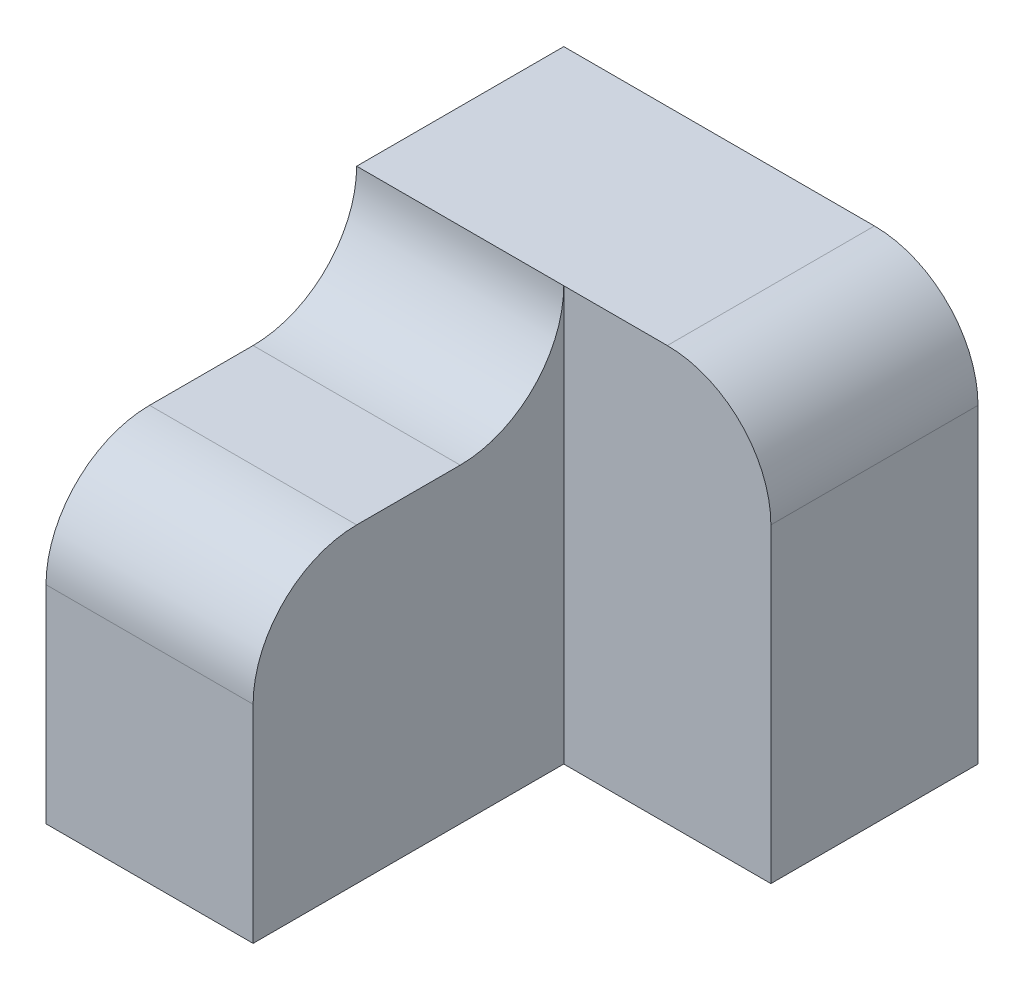
ISO-10303-21;
HEADER;
FILE_DESCRIPTION(('STEP AP214'),'2;1');
FILE_NAME('part.step','',(''),(''),'','','');
FILE_SCHEMA(('AUTOMOTIVE_DESIGN { 1 0 10303 214 1 1 1 1 }'));
ENDSEC;
DATA;
#1=APPLICATION_CONTEXT('core data for automotive mechanical design processes');
#2=APPLICATION_PROTOCOL_DEFINITION('international standard','automotive_design',2000,#1);
#3=PRODUCT_CONTEXT('',#1,'mechanical');
#4=PRODUCT('Part','Part','',(#3));
#5=PRODUCT_RELATED_PRODUCT_CATEGORY('part','',(#4));
#6=PRODUCT_DEFINITION_FORMATION('','',#4);
#7=PRODUCT_DEFINITION_CONTEXT('part definition',#1,'design');
#8=PRODUCT_DEFINITION('design','',#6,#7);
#9=PRODUCT_DEFINITION_SHAPE('','',#8);
#10=(LENGTH_UNIT() NAMED_UNIT(*) SI_UNIT(.MILLI.,.METRE.));
#11=(NAMED_UNIT(*) PLANE_ANGLE_UNIT() SI_UNIT($,.RADIAN.));
#12=(NAMED_UNIT(*) SI_UNIT($,.STERADIAN.) SOLID_ANGLE_UNIT());
#13=UNCERTAINTY_MEASURE_WITH_UNIT(LENGTH_MEASURE(1.E-05),#10,'distance_accuracy_value','');
#14=(GEOMETRIC_REPRESENTATION_CONTEXT(3) GLOBAL_UNCERTAINTY_ASSIGNED_CONTEXT((#13)) GLOBAL_UNIT_ASSIGNED_CONTEXT((#10,
#11,#12)) REPRESENTATION_CONTEXT('',''));
#15=CARTESIAN_POINT('',(0.,0.,0.));
#16=DIRECTION('',(0.,0.,1.));
#17=DIRECTION('',(1.,0.,0.));
#18=AXIS2_PLACEMENT_3D('',#15,#16,#17);
#19=CARTESIAN_POINT('',(-10.,0.,30.));
#20=DIRECTION('',(0.,-1.,0.));
#21=DIRECTION('',(1.,0.,0.));
#22=AXIS2_PLACEMENT_3D('',#19,#20,#21);
#23=PLANE('',#22);
#24=DIRECTION('',(0.,0.,-1.));
#25=VECTOR('',#24,1.);
#26=CARTESIAN_POINT('',(-10.,0.,30.));
#27=LINE('',#26,#25);
#28=CARTESIAN_POINT('',(-10.,0.,20.));
#29=VERTEX_POINT('',#28);
#30=CARTESIAN_POINT('',(-10.,0.,10.));
#31=VERTEX_POINT('',#30);
#32=EDGE_CURVE('E161',#29,#31,#27,.T.);
#33=ORIENTED_EDGE('',*,*,#32,.T.);
#34=DIRECTION('',(-1.,0.,0.));
#35=VECTOR('',#34,1.);
#36=CARTESIAN_POINT('',(-10.,0.,10.));
#37=LINE('',#36,#35);
#38=CARTESIAN_POINT('',(-30.,0.,10.));
#39=VERTEX_POINT('',#38);
#40=EDGE_CURVE('E174',#31,#39,#37,.T.);
#41=ORIENTED_EDGE('',*,*,#40,.T.);
#42=DIRECTION('',(0.,0.,-1.));
#43=VECTOR('',#42,1.);
#44=CARTESIAN_POINT('',(-30.,0.,30.));
#45=LINE('',#44,#43);
#46=CARTESIAN_POINT('',(-30.,0.,20.));
#47=VERTEX_POINT('',#46);
#48=EDGE_CURVE('E170',#47,#39,#45,.T.);
#49=ORIENTED_EDGE('',*,*,#48,.F.);
#50=DIRECTION('',(-1.,0.,0.));
#51=VECTOR('',#50,1.);
#52=CARTESIAN_POINT('',(-10.,0.,20.));
#53=LINE('',#52,#51);
#54=EDGE_CURVE('E172',#47,#29,#53,.F.);
#55=ORIENTED_EDGE('',*,*,#54,.T.);
#56=EDGE_LOOP('',(#33,#41,#49,#55));
#57=FACE_BOUND('',#56,.T.);
#58=ADVANCED_FACE('F35',(#57),#23,.F.);
#59=CARTESIAN_POINT('',(-30.,0.,30.));
#60=DIRECTION('',(1.,0.,0.));
#61=DIRECTION('',(0.,0.,-1.));
#62=AXIS2_PLACEMENT_3D('',#59,#60,#61);
#63=PLANE('',#62);
#64=DIRECTION('',(0.,-1.,0.));
#65=VECTOR('',#64,1.);
#66=CARTESIAN_POINT('',(-30.,0.,30.));
#67=LINE('',#66,#65);
#68=CARTESIAN_POINT('',(-30.,-10.,30.));
#69=VERTEX_POINT('',#68);
#70=CARTESIAN_POINT('',(-30.,-30.,30.));
#71=VERTEX_POINT('',#70);
#72=EDGE_CURVE('E155',#69,#71,#67,.T.);
#73=ORIENTED_EDGE('',*,*,#72,.F.);
#74=CARTESIAN_POINT('',(-30.,-10.,20.));
#75=DIRECTION('',(1.,0.,0.));
#76=DIRECTION('',(0.,0.,-1.));
#77=AXIS2_PLACEMENT_3D('',#74,#75,#76);
#78=CIRCLE('',#77,10.);
#79=EDGE_CURVE('E58',#69,#47,#78,.F.);
#80=ORIENTED_EDGE('',*,*,#79,.T.);
#81=ORIENTED_EDGE('',*,*,#48,.T.);
#82=CARTESIAN_POINT('',(-30.,10.,10.));
#83=DIRECTION('',(1.,0.,0.));
#84=DIRECTION('',(0.,0.,-1.));
#85=AXIS2_PLACEMENT_3D('',#82,#83,#84);
#86=CIRCLE('',#85,10.);
#87=CARTESIAN_POINT('',(-30.,9.99999999999999,0.));
#88=VERTEX_POINT('',#87);
#89=EDGE_CURVE('E43',#39,#88,#86,.T.);
#90=ORIENTED_EDGE('',*,*,#89,.T.);
#91=DIRECTION('',(0.,0.,1.));
#92=VECTOR('',#91,1.);
#93=CARTESIAN_POINT('',(-30.,9.99999999999999,-20.));
#94=LINE('',#93,#92);
#95=CARTESIAN_POINT('',(-30.,9.99999999999999,-20.));
#96=VERTEX_POINT('',#95);
#97=EDGE_CURVE('E116',#96,#88,#94,.T.);
#98=ORIENTED_EDGE('',*,*,#97,.F.);
#99=DIRECTION('',(0.,-1.,0.));
#100=VECTOR('',#99,1.);
#101=CARTESIAN_POINT('',(-30.,9.99999999999999,-20.));
#102=LINE('',#101,#100);
#103=CARTESIAN_POINT('',(-30.,-30.,-20.));
#104=VERTEX_POINT('',#103);
#105=EDGE_CURVE('E123',#96,#104,#102,.T.);
#106=ORIENTED_EDGE('',*,*,#105,.T.);
#107=DIRECTION('',(0.,0.,-1.));
#108=VECTOR('',#107,1.);
#109=CARTESIAN_POINT('',(-30.,-30.,30.));
#110=LINE('',#109,#108);
#111=EDGE_CURVE('E168',#71,#104,#110,.T.);
#112=ORIENTED_EDGE('',*,*,#111,.F.);
#113=EDGE_LOOP('',(#73,#80,#81,#90,#98,#106,#112));
#114=FACE_BOUND('',#113,.T.);
#115=ADVANCED_FACE('F129',(#114),#63,.F.);
#116=CARTESIAN_POINT('',(-30.,-30.,30.));
#117=DIRECTION('',(0.,1.,0.));
#118=DIRECTION('',(0.,0.,1.));
#119=AXIS2_PLACEMENT_3D('',#116,#117,#118);
#120=PLANE('',#119);
#121=ORIENTED_EDGE('',*,*,#111,.T.);
#122=DIRECTION('',(1.,0.,0.));
#123=VECTOR('',#122,1.);
#124=CARTESIAN_POINT('',(-30.,-30.,-20.));
#125=LINE('',#124,#123);
#126=CARTESIAN_POINT('',(10.,-30.,-20.));
#127=VERTEX_POINT('',#126);
#128=EDGE_CURVE('E139',#104,#127,#125,.T.);
#129=ORIENTED_EDGE('',*,*,#128,.T.);
#130=DIRECTION('',(0.,0.,1.));
#131=VECTOR('',#130,1.);
#132=CARTESIAN_POINT('',(10.,-30.,-20.));
#133=LINE('',#132,#131);
#134=CARTESIAN_POINT('',(10.,-30.,0.));
#135=VERTEX_POINT('',#134);
#136=EDGE_CURVE('E132',#127,#135,#133,.T.);
#137=ORIENTED_EDGE('',*,*,#136,.T.);
#138=DIRECTION('',(1.,0.,0.));
#139=VECTOR('',#138,1.);
#140=CARTESIAN_POINT('',(-30.,-30.,0.));
#141=LINE('',#140,#139);
#142=CARTESIAN_POINT('',(-10.,-30.,0.));
#143=VERTEX_POINT('',#142);
#144=EDGE_CURVE('E148',#143,#135,#141,.T.);
#145=ORIENTED_EDGE('',*,*,#144,.F.);
#146=DIRECTION('',(0.,0.,-1.));
#147=VECTOR('',#146,1.);
#148=CARTESIAN_POINT('',(-10.,-30.,30.));
#149=LINE('',#148,#147);
#150=CARTESIAN_POINT('',(-10.,-30.,30.));
#151=VERTEX_POINT('',#150);
#152=EDGE_CURVE('E165',#151,#143,#149,.T.);
#153=ORIENTED_EDGE('',*,*,#152,.F.);
#154=DIRECTION('',(1.,0.,0.));
#155=VECTOR('',#154,1.);
#156=CARTESIAN_POINT('',(-30.,-30.,30.));
#157=LINE('',#156,#155);
#158=EDGE_CURVE('E157',#71,#151,#157,.T.);
#159=ORIENTED_EDGE('',*,*,#158,.F.);
#160=EDGE_LOOP('',(#121,#129,#137,#145,#153,#159));
#161=FACE_BOUND('',#160,.T.);
#162=ADVANCED_FACE('F198',(#161),#120,.F.);
#163=CARTESIAN_POINT('',(-10.,-30.,30.));
#164=DIRECTION('',(-1.,0.,0.));
#165=DIRECTION('',(0.,0.,1.));
#166=AXIS2_PLACEMENT_3D('',#163,#164,#165);
#167=PLANE('',#166);
#168=ORIENTED_EDGE('',*,*,#32,.F.);
#169=CARTESIAN_POINT('',(-10.,-10.,20.));
#170=DIRECTION('',(-1.,0.,0.));
#171=DIRECTION('',(0.,0.,1.));
#172=AXIS2_PLACEMENT_3D('',#169,#170,#171);
#173=CIRCLE('',#172,10.);
#174=CARTESIAN_POINT('',(-10.,-10.,30.));
#175=VERTEX_POINT('',#174);
#176=EDGE_CURVE('E50',#29,#175,#173,.F.);
#177=ORIENTED_EDGE('',*,*,#176,.T.);
#178=DIRECTION('',(0.,1.,0.));
#179=VECTOR('',#178,1.);
#180=CARTESIAN_POINT('',(-10.,-30.,30.));
#181=LINE('',#180,#179);
#182=EDGE_CURVE('E159',#151,#175,#181,.T.);
#183=ORIENTED_EDGE('',*,*,#182,.F.);
#184=ORIENTED_EDGE('',*,*,#152,.T.);
#185=DIRECTION('',(0.,1.,0.));
#186=VECTOR('',#185,1.);
#187=CARTESIAN_POINT('',(-10.,-30.,0.));
#188=LINE('',#187,#186);
#189=CARTESIAN_POINT('',(-10.,10.,0.));
#190=VERTEX_POINT('',#189);
#191=EDGE_CURVE('E153',#143,#190,#188,.T.);
#192=ORIENTED_EDGE('',*,*,#191,.T.);
#193=CARTESIAN_POINT('',(-10.,10.,10.));
#194=DIRECTION('',(-1.,0.,0.));
#195=DIRECTION('',(0.,0.,1.));
#196=AXIS2_PLACEMENT_3D('',#193,#194,#195);
#197=CIRCLE('',#196,10.);
#198=EDGE_CURVE('E11',#190,#31,#197,.T.);
#199=ORIENTED_EDGE('',*,*,#198,.T.);
#200=EDGE_LOOP('',(#168,#177,#183,#184,#192,#199));
#201=FACE_BOUND('',#200,.T.);
#202=ADVANCED_FACE('F195',(#201),#167,.F.);
#203=CARTESIAN_POINT('',(0.,0.,30.));
#204=DIRECTION('',(0.,0.,1.));
#205=DIRECTION('',(1.,0.,0.));
#206=AXIS2_PLACEMENT_3D('',#203,#204,#205);
#207=PLANE('',#206);
#208=ORIENTED_EDGE('',*,*,#182,.T.);
#209=DIRECTION('',(-1.,0.,0.));
#210=VECTOR('',#209,1.);
#211=CARTESIAN_POINT('',(-30.,-10.,30.));
#212=LINE('',#211,#210);
#213=EDGE_CURVE('E185',#175,#69,#212,.T.);
#214=ORIENTED_EDGE('',*,*,#213,.T.);
#215=ORIENTED_EDGE('',*,*,#72,.T.);
#216=ORIENTED_EDGE('',*,*,#158,.T.);
#217=EDGE_LOOP('',(#208,#214,#215,#216));
#218=FACE_BOUND('',#217,.T.);
#219=ADVANCED_FACE('F192',(#218),#207,.T.);
#220=CARTESIAN_POINT('',(0.,0.,0.));
#221=DIRECTION('',(0.,0.,1.));
#222=DIRECTION('',(1.,0.,0.));
#223=AXIS2_PLACEMENT_3D('',#220,#221,#222);
#224=PLANE('',#223);
#225=DIRECTION('',(-1.,0.,0.));
#226=VECTOR('',#225,1.);
#227=CARTESIAN_POINT('',(10.,10.,0.));
#228=LINE('',#227,#226);
#229=CARTESIAN_POINT('',(0.,10.,0.));
#230=VERTEX_POINT('',#229);
#231=EDGE_CURVE('E147',#230,#190,#228,.T.);
#232=ORIENTED_EDGE('',*,*,#231,.T.);
#233=ORIENTED_EDGE('',*,*,#191,.F.);
#234=ORIENTED_EDGE('',*,*,#144,.T.);
#235=DIRECTION('',(0.,1.,0.));
#236=VECTOR('',#235,1.);
#237=CARTESIAN_POINT('',(10.,-30.,0.));
#238=LINE('',#237,#236);
#239=CARTESIAN_POINT('',(10.,0.,0.));
#240=VERTEX_POINT('',#239);
#241=EDGE_CURVE('E124',#135,#240,#238,.T.);
#242=ORIENTED_EDGE('',*,*,#241,.T.);
#243=CARTESIAN_POINT('',(0.,0.,0.));
#244=DIRECTION('',(0.,0.,1.));
#245=DIRECTION('',(1.,0.,0.));
#246=AXIS2_PLACEMENT_3D('',#243,#244,#245);
#247=CIRCLE('',#246,10.);
#248=EDGE_CURVE('E177',#240,#230,#247,.T.);
#249=ORIENTED_EDGE('',*,*,#248,.T.);
#250=EDGE_LOOP('',(#232,#233,#234,#242,#249));
#251=FACE_BOUND('',#250,.T.);
#252=ADVANCED_FACE('F202',(#251),#224,.T.);
#253=CARTESIAN_POINT('',(10.,10.,-20.));
#254=DIRECTION('',(0.,1.,0.));
#255=DIRECTION('',(-1.,0.,0.));
#256=AXIS2_PLACEMENT_3D('',#253,#254,#255);
#257=PLANE('',#256);
#258=ORIENTED_EDGE('',*,*,#231,.F.);
#259=DIRECTION('',(0.,0.,1.));
#260=VECTOR('',#259,1.);
#261=CARTESIAN_POINT('',(0.,10.,-20.));
#262=LINE('',#261,#260);
#263=CARTESIAN_POINT('',(0.,10.,-20.));
#264=VERTEX_POINT('',#263);
#265=EDGE_CURVE('E119',#230,#264,#262,.F.);
#266=ORIENTED_EDGE('',*,*,#265,.T.);
#267=DIRECTION('',(-1.,0.,0.));
#268=VECTOR('',#267,1.);
#269=CARTESIAN_POINT('',(10.,10.,-20.));
#270=LINE('',#269,#268);
#271=EDGE_CURVE('E111',#264,#96,#270,.T.);
#272=ORIENTED_EDGE('',*,*,#271,.T.);
#273=ORIENTED_EDGE('',*,*,#97,.T.);
#274=EDGE_CURVE('E145',#190,#88,#228,.T.);
#275=ORIENTED_EDGE('',*,*,#274,.F.);
#276=EDGE_LOOP('',(#258,#266,#272,#273,#275));
#277=FACE_BOUND('',#276,.T.);
#278=ADVANCED_FACE('F114',(#277),#257,.T.);
#279=CARTESIAN_POINT('',(10.,-30.,-20.));
#280=DIRECTION('',(1.,0.,0.));
#281=DIRECTION('',(0.,0.,-1.));
#282=AXIS2_PLACEMENT_3D('',#279,#280,#281);
#283=PLANE('',#282);
#284=DIRECTION('',(0.,1.,0.));
#285=VECTOR('',#284,1.);
#286=CARTESIAN_POINT('',(10.,-30.,-20.));
#287=LINE('',#286,#285);
#288=CARTESIAN_POINT('',(10.,0.,-20.));
#289=VERTEX_POINT('',#288);
#290=EDGE_CURVE('E133',#127,#289,#287,.T.);
#291=ORIENTED_EDGE('',*,*,#290,.T.);
#292=DIRECTION('',(0.,0.,1.));
#293=VECTOR('',#292,1.);
#294=CARTESIAN_POINT('',(10.,0.,-20.));
#295=LINE('',#294,#293);
#296=EDGE_CURVE('E179',#289,#240,#295,.T.);
#297=ORIENTED_EDGE('',*,*,#296,.T.);
#298=ORIENTED_EDGE('',*,*,#241,.F.);
#299=ORIENTED_EDGE('',*,*,#136,.F.);
#300=EDGE_LOOP('',(#291,#297,#298,#299));
#301=FACE_BOUND('',#300,.T.);
#302=ADVANCED_FACE('F214',(#301),#283,.T.);
#303=CARTESIAN_POINT('',(0.,0.,-20.));
#304=DIRECTION('',(0.,0.,1.));
#305=DIRECTION('',(1.,0.,0.));
#306=AXIS2_PLACEMENT_3D('',#303,#304,#305);
#307=PLANE('',#306);
#308=ORIENTED_EDGE('',*,*,#271,.F.);
#309=CARTESIAN_POINT('',(0.,0.,-20.));
#310=DIRECTION('',(0.,0.,1.));
#311=DIRECTION('',(1.,0.,0.));
#312=AXIS2_PLACEMENT_3D('',#309,#310,#311);
#313=CIRCLE('',#312,10.);
#314=EDGE_CURVE('E183',#264,#289,#313,.F.);
#315=ORIENTED_EDGE('',*,*,#314,.T.);
#316=ORIENTED_EDGE('',*,*,#290,.F.);
#317=ORIENTED_EDGE('',*,*,#128,.F.);
#318=ORIENTED_EDGE('',*,*,#105,.F.);
#319=EDGE_LOOP('',(#308,#315,#316,#317,#318));
#320=FACE_BOUND('',#319,.T.);
#321=ADVANCED_FACE('F136',(#320),#307,.F.);
#322=CARTESIAN_POINT('',(-10.,10.,10.));
#323=DIRECTION('',(-1.,0.,0.));
#324=DIRECTION('',(0.,-1.,0.));
#325=AXIS2_PLACEMENT_3D('',#322,#323,#324);
#326=CYLINDRICAL_SURFACE('',#325,10.);
#327=ORIENTED_EDGE('',*,*,#198,.F.);
#328=ORIENTED_EDGE('',*,*,#274,.T.);
#329=ORIENTED_EDGE('',*,*,#89,.F.);
#330=ORIENTED_EDGE('',*,*,#40,.F.);
#331=EDGE_LOOP('',(#327,#328,#329,#330));
#332=FACE_BOUND('',#331,.T.);
#333=ADVANCED_FACE('F205',(#332),#326,.F.);
#334=CARTESIAN_POINT('',(0.,0.,-20.));
#335=DIRECTION('',(0.,0.,1.));
#336=DIRECTION('',(1.,0.,0.));
#337=AXIS2_PLACEMENT_3D('',#334,#335,#336);
#338=CYLINDRICAL_SURFACE('',#337,10.);
#339=ORIENTED_EDGE('',*,*,#314,.F.);
#340=ORIENTED_EDGE('',*,*,#265,.F.);
#341=ORIENTED_EDGE('',*,*,#248,.F.);
#342=ORIENTED_EDGE('',*,*,#296,.F.);
#343=EDGE_LOOP('',(#339,#340,#341,#342));
#344=FACE_BOUND('',#343,.T.);
#345=ADVANCED_FACE('F207',(#344),#338,.T.);
#346=CARTESIAN_POINT('',(0.,-10.,20.));
#347=DIRECTION('',(1.,0.,0.));
#348=DIRECTION('',(0.,1.,0.));
#349=AXIS2_PLACEMENT_3D('',#346,#347,#348);
#350=CYLINDRICAL_SURFACE('',#349,10.);
#351=ORIENTED_EDGE('',*,*,#176,.F.);
#352=ORIENTED_EDGE('',*,*,#54,.F.);
#353=ORIENTED_EDGE('',*,*,#79,.F.);
#354=ORIENTED_EDGE('',*,*,#213,.F.);
#355=EDGE_LOOP('',(#351,#352,#353,#354));
#356=FACE_BOUND('',#355,.T.);
#357=ADVANCED_FACE('F37',(#356),#350,.T.);
#358=CLOSED_SHELL('',(#58,#115,#162,#202,#219,#252,#278,#302,#321,#333,#345,#357));
#359=MANIFOLD_SOLID_BREP('B2',#358);
#360=ADVANCED_BREP_SHAPE_REPRESENTATION('',(#18,#359),#14);
#361=SHAPE_DEFINITION_REPRESENTATION(#9,#360);
ENDSEC;
END-ISO-10303-21;
